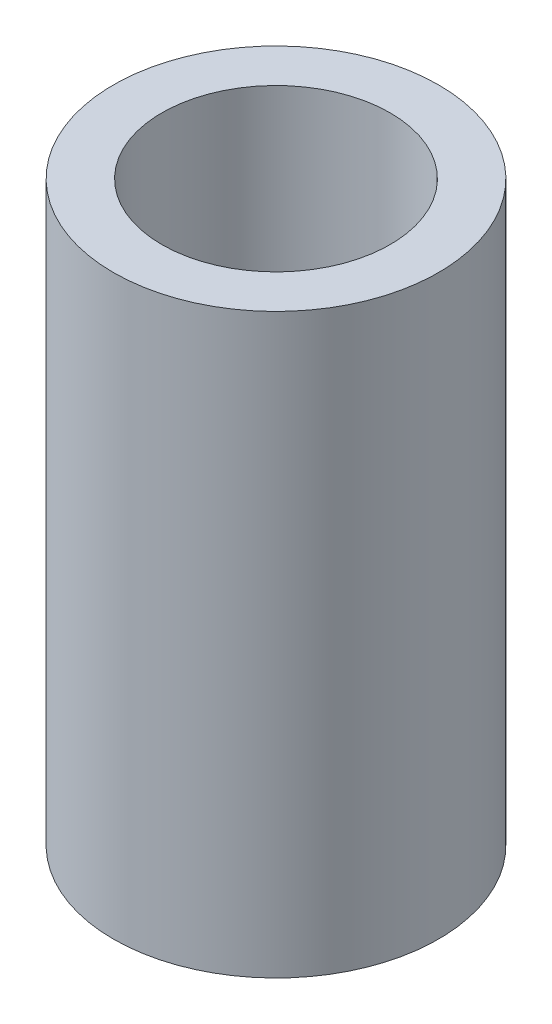
ISO-10303-21;
HEADER;
FILE_DESCRIPTION(('STEP AP214'),'2;1');
FILE_NAME('part.step','',(''),(''),'','','');
FILE_SCHEMA(('AUTOMOTIVE_DESIGN { 1 0 10303 214 1 1 1 1 }'));
ENDSEC;
DATA;
#1=APPLICATION_CONTEXT('core data for automotive mechanical design processes');
#2=APPLICATION_PROTOCOL_DEFINITION('international standard','automotive_design',2000,#1);
#3=PRODUCT_CONTEXT('',#1,'mechanical');
#4=PRODUCT('Part','Part','',(#3));
#5=PRODUCT_RELATED_PRODUCT_CATEGORY('part','',(#4));
#6=PRODUCT_DEFINITION_FORMATION('','',#4);
#7=PRODUCT_DEFINITION_CONTEXT('part definition',#1,'design');
#8=PRODUCT_DEFINITION('design','',#6,#7);
#9=PRODUCT_DEFINITION_SHAPE('','',#8);
#10=(LENGTH_UNIT() NAMED_UNIT(*) SI_UNIT(.MILLI.,.METRE.));
#11=(NAMED_UNIT(*) PLANE_ANGLE_UNIT() SI_UNIT($,.RADIAN.));
#12=(NAMED_UNIT(*) SI_UNIT($,.STERADIAN.) SOLID_ANGLE_UNIT());
#13=UNCERTAINTY_MEASURE_WITH_UNIT(LENGTH_MEASURE(1.E-05),#10,'distance_accuracy_value','');
#14=(GEOMETRIC_REPRESENTATION_CONTEXT(3) GLOBAL_UNCERTAINTY_ASSIGNED_CONTEXT((#13)) GLOBAL_UNIT_ASSIGNED_CONTEXT((#10,
#11,#12)) REPRESENTATION_CONTEXT('',''));
#15=CARTESIAN_POINT('',(0.,0.,0.));
#16=DIRECTION('',(0.,0.,1.));
#17=DIRECTION('',(1.,0.,0.));
#18=AXIS2_PLACEMENT_3D('',#15,#16,#17);
#19=CARTESIAN_POINT('',(0.,88.7727123681228,0.));
#20=DIRECTION('',(0.,-1.,0.));
#21=DIRECTION('',(0.,0.,-1.));
#22=AXIS2_PLACEMENT_3D('',#19,#20,#21);
#23=CYLINDRICAL_SURFACE('',#22,25.);
#24=CARTESIAN_POINT('',(0.,88.7727123681228,0.));
#25=DIRECTION('',(0.,1.,0.));
#26=DIRECTION('',(0.,0.,1.));
#27=AXIS2_PLACEMENT_3D('',#24,#25,#26);
#28=CIRCLE('',#27,25.);
#29=CARTESIAN_POINT('',(0.,88.7727123681228,25.));
#30=VERTEX_POINT('',#29);
#31=EDGE_CURVE('E10',#30,#30,#28,.T.);
#32=ORIENTED_EDGE('',*,*,#31,.F.);
#33=EDGE_LOOP('',(#32));
#34=FACE_BOUND('',#33,.T.);
#35=CARTESIAN_POINT('',(0.,0.,0.));
#36=DIRECTION('',(0.,1.,0.));
#37=DIRECTION('',(0.,0.,1.));
#38=AXIS2_PLACEMENT_3D('',#35,#36,#37);
#39=CIRCLE('',#38,25.);
#40=CARTESIAN_POINT('',(0.,0.,25.));
#41=VERTEX_POINT('',#40);
#42=EDGE_CURVE('E37',#41,#41,#39,.T.);
#43=ORIENTED_EDGE('',*,*,#42,.T.);
#44=EDGE_LOOP('',(#43));
#45=FACE_BOUND('',#44,.T.);
#46=ADVANCED_FACE('F40',(#34,#45),#23,.T.);
#47=CARTESIAN_POINT('',(0.,88.7727123681228,0.));
#48=DIRECTION('',(0.,1.,0.));
#49=DIRECTION('',(0.,0.,1.));
#50=AXIS2_PLACEMENT_3D('',#47,#48,#49);
#51=PLANE('',#50);
#52=CARTESIAN_POINT('',(0.,88.7727123681228,0.));
#53=DIRECTION('',(0.,1.,0.));
#54=DIRECTION('',(0.,0.,1.));
#55=AXIS2_PLACEMENT_3D('',#52,#53,#54);
#56=CIRCLE('',#55,17.5560061944365);
#57=CARTESIAN_POINT('',(0.,88.7727123681228,17.5560061944365));
#58=VERTEX_POINT('',#57);
#59=EDGE_CURVE('E50',#58,#58,#56,.T.);
#60=ORIENTED_EDGE('',*,*,#59,.F.);
#61=EDGE_LOOP('',(#60));
#62=FACE_BOUND('',#61,.T.);
#63=ORIENTED_EDGE('',*,*,#31,.T.);
#64=EDGE_LOOP('',(#63));
#65=FACE_BOUND('',#64,.T.);
#66=ADVANCED_FACE('F59',(#62,#65),#51,.T.);
#67=CARTESIAN_POINT('',(0.,0.,0.));
#68=DIRECTION('',(0.,1.,0.));
#69=DIRECTION('',(0.,0.,1.));
#70=AXIS2_PLACEMENT_3D('',#67,#68,#69);
#71=PLANE('',#70);
#72=CARTESIAN_POINT('',(0.,0.,0.));
#73=DIRECTION('',(0.,1.,0.));
#74=DIRECTION('',(0.,0.,1.));
#75=AXIS2_PLACEMENT_3D('',#72,#73,#74);
#76=CIRCLE('',#75,17.5560061944365);
#77=CARTESIAN_POINT('',(0.,0.,17.5560061944365));
#78=VERTEX_POINT('',#77);
#79=EDGE_CURVE('E47',#78,#78,#76,.T.);
#80=ORIENTED_EDGE('',*,*,#79,.T.);
#81=EDGE_LOOP('',(#80));
#82=FACE_BOUND('',#81,.T.);
#83=ORIENTED_EDGE('',*,*,#42,.F.);
#84=EDGE_LOOP('',(#83));
#85=FACE_BOUND('',#84,.T.);
#86=ADVANCED_FACE('F58',(#82,#85),#71,.F.);
#87=CARTESIAN_POINT('',(0.,88.7727123681228,0.));
#88=DIRECTION('',(0.,-1.,0.));
#89=DIRECTION('',(0.,0.,-1.));
#90=AXIS2_PLACEMENT_3D('',#87,#88,#89);
#91=CYLINDRICAL_SURFACE('',#90,17.5560061944365);
#92=ORIENTED_EDGE('',*,*,#59,.T.);
#93=EDGE_LOOP('',(#92));
#94=FACE_BOUND('',#93,.T.);
#95=ORIENTED_EDGE('',*,*,#79,.F.);
#96=EDGE_LOOP('',(#95));
#97=FACE_BOUND('',#96,.T.);
#98=ADVANCED_FACE('F54',(#94,#97),#91,.F.);
#99=CLOSED_SHELL('',(#46,#66,#86,#98));
#100=MANIFOLD_SOLID_BREP('B2',#99);
#101=ADVANCED_BREP_SHAPE_REPRESENTATION('',(#18,#100),#14);
#102=SHAPE_DEFINITION_REPRESENTATION(#9,#101);
ENDSEC;
END-ISO-10303-21;
